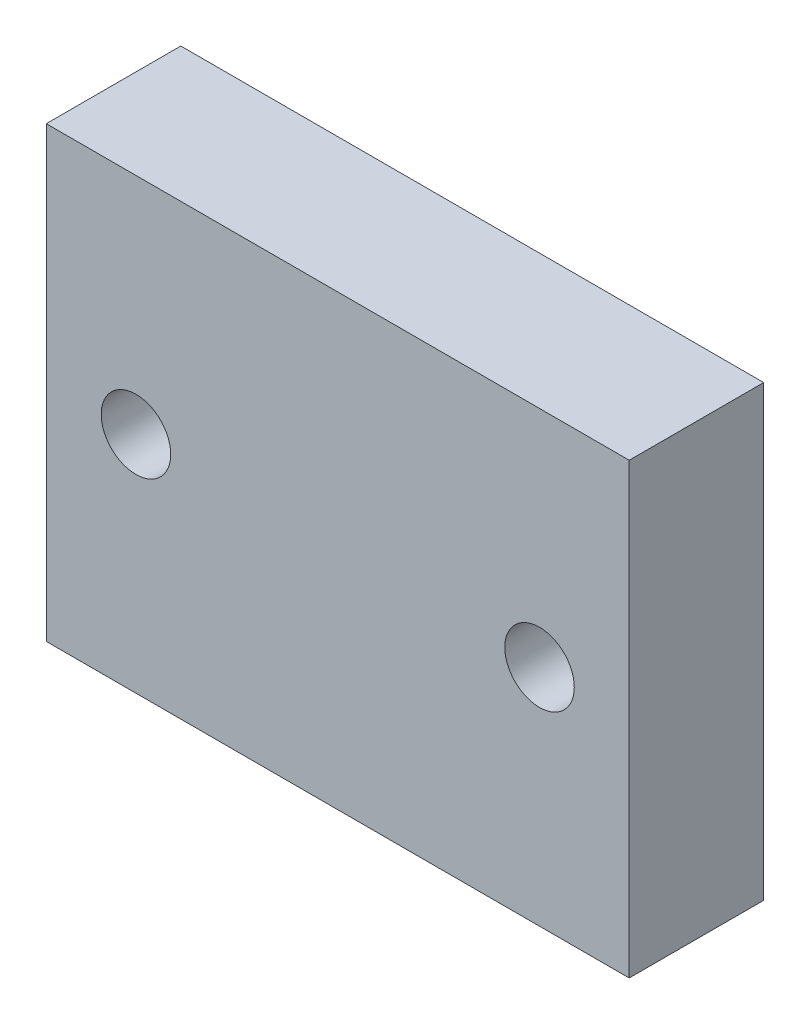
ISO-10303-21;
HEADER;
FILE_DESCRIPTION(('STEP AP214'),'2;1');
FILE_NAME('part.step','',(''),(''),'','','');
FILE_SCHEMA(('AUTOMOTIVE_DESIGN { 1 0 10303 214 1 1 1 1 }'));
ENDSEC;
DATA;
#1=APPLICATION_CONTEXT('core data for automotive mechanical design processes');
#2=APPLICATION_PROTOCOL_DEFINITION('international standard','automotive_design',2000,#1);
#3=PRODUCT_CONTEXT('',#1,'mechanical');
#4=PRODUCT('Part','Part','',(#3));
#5=PRODUCT_RELATED_PRODUCT_CATEGORY('part','',(#4));
#6=PRODUCT_DEFINITION_FORMATION('','',#4);
#7=PRODUCT_DEFINITION_CONTEXT('part definition',#1,'design');
#8=PRODUCT_DEFINITION('design','',#6,#7);
#9=PRODUCT_DEFINITION_SHAPE('','',#8);
#10=(LENGTH_UNIT() NAMED_UNIT(*) SI_UNIT(.MILLI.,.METRE.));
#11=(NAMED_UNIT(*) PLANE_ANGLE_UNIT() SI_UNIT($,.RADIAN.));
#12=(NAMED_UNIT(*) SI_UNIT($,.STERADIAN.) SOLID_ANGLE_UNIT());
#13=UNCERTAINTY_MEASURE_WITH_UNIT(LENGTH_MEASURE(1.E-05),#10,'distance_accuracy_value','');
#14=(GEOMETRIC_REPRESENTATION_CONTEXT(3) GLOBAL_UNCERTAINTY_ASSIGNED_CONTEXT((#13)) GLOBAL_UNIT_ASSIGNED_CONTEXT((#10,
#11,#12)) REPRESENTATION_CONTEXT('',''));
#15=CARTESIAN_POINT('',(0.,0.,0.));
#16=DIRECTION('',(0.,0.,1.));
#17=DIRECTION('',(1.,0.,0.));
#18=AXIS2_PLACEMENT_3D('',#15,#16,#17);
#19=CARTESIAN_POINT('',(0.,0.,6.));
#20=DIRECTION('',(0.,0.,1.));
#21=DIRECTION('',(1.,0.,0.));
#22=AXIS2_PLACEMENT_3D('',#19,#20,#21);
#23=PLANE('',#22);
#24=CARTESIAN_POINT('',(9.,0.,6.));
#25=DIRECTION('',(0.,0.,1.));
#26=DIRECTION('',(1.,0.,0.));
#27=AXIS2_PLACEMENT_3D('',#24,#25,#26);
#28=CIRCLE('',#27,1.55);
#29=CARTESIAN_POINT('',(10.55,0.,6.));
#30=VERTEX_POINT('',#29);
#31=EDGE_CURVE('E136',#30,#30,#28,.T.);
#32=ORIENTED_EDGE('',*,*,#31,.F.);
#33=EDGE_LOOP('',(#32));
#34=FACE_BOUND('',#33,.T.);
#35=DIRECTION('',(0.,-1.,0.));
#36=VECTOR('',#35,1.);
#37=CARTESIAN_POINT('',(-13.,-10.,6.));
#38=LINE('',#37,#36);
#39=CARTESIAN_POINT('',(-13.,10.,6.));
#40=VERTEX_POINT('',#39);
#41=CARTESIAN_POINT('',(-13.,-10.,6.));
#42=VERTEX_POINT('',#41);
#43=EDGE_CURVE('E142',#40,#42,#38,.T.);
#44=ORIENTED_EDGE('',*,*,#43,.T.);
#45=DIRECTION('',(1.,0.,0.));
#46=VECTOR('',#45,1.);
#47=CARTESIAN_POINT('',(13.,-10.,6.));
#48=LINE('',#47,#46);
#49=CARTESIAN_POINT('',(13.,-10.,6.));
#50=VERTEX_POINT('',#49);
#51=EDGE_CURVE('E145',#42,#50,#48,.T.);
#52=ORIENTED_EDGE('',*,*,#51,.T.);
#53=DIRECTION('',(0.,1.,0.));
#54=VECTOR('',#53,1.);
#55=CARTESIAN_POINT('',(13.,-10.,6.));
#56=LINE('',#55,#54);
#57=CARTESIAN_POINT('',(13.,10.,6.));
#58=VERTEX_POINT('',#57);
#59=EDGE_CURVE('E148',#50,#58,#56,.T.);
#60=ORIENTED_EDGE('',*,*,#59,.T.);
#61=DIRECTION('',(-1.,0.,0.));
#62=VECTOR('',#61,1.);
#63=CARTESIAN_POINT('',(13.,10.,6.));
#64=LINE('',#63,#62);
#65=EDGE_CURVE('E150',#58,#40,#64,.T.);
#66=ORIENTED_EDGE('',*,*,#65,.T.);
#67=EDGE_LOOP('',(#44,#52,#60,#66));
#68=FACE_BOUND('',#67,.T.);
#69=CARTESIAN_POINT('',(-9.,0.,6.));
#70=DIRECTION('',(0.,0.,1.));
#71=DIRECTION('',(1.,0.,0.));
#72=AXIS2_PLACEMENT_3D('',#69,#70,#71);
#73=CIRCLE('',#72,1.55);
#74=CARTESIAN_POINT('',(-7.45,0.,6.));
#75=VERTEX_POINT('',#74);
#76=EDGE_CURVE('E130',#75,#75,#73,.T.);
#77=ORIENTED_EDGE('',*,*,#76,.F.);
#78=EDGE_LOOP('',(#77));
#79=FACE_BOUND('',#78,.T.);
#80=ADVANCED_FACE('F34',(#34,#68,#79),#23,.T.);
#81=CARTESIAN_POINT('',(0.,0.,0.));
#82=DIRECTION('',(0.,0.,1.));
#83=DIRECTION('',(1.,0.,0.));
#84=AXIS2_PLACEMENT_3D('',#81,#82,#83);
#85=PLANE('',#84);
#86=DIRECTION('',(0.,-1.,0.));
#87=VECTOR('',#86,1.);
#88=CARTESIAN_POINT('',(5.,4.,0.));
#89=LINE('',#88,#87);
#90=CARTESIAN_POINT('',(5.,5.00000000000001,0.));
#91=VERTEX_POINT('',#90);
#92=CARTESIAN_POINT('',(5.,2.,0.));
#93=VERTEX_POINT('',#92);
#94=EDGE_CURVE('E50',#91,#93,#89,.T.);
#95=ORIENTED_EDGE('',*,*,#94,.F.);
#96=DIRECTION('',(-1.,0.,0.));
#97=VECTOR('',#96,1.);
#98=CARTESIAN_POINT('',(0.,5.00000000000001,0.));
#99=LINE('',#98,#97);
#100=CARTESIAN_POINT('',(-5.,5.00000000000001,0.));
#101=VERTEX_POINT('',#100);
#102=EDGE_CURVE('E171',#91,#101,#99,.T.);
#103=ORIENTED_EDGE('',*,*,#102,.T.);
#104=DIRECTION('',(0.,1.,0.));
#105=VECTOR('',#104,1.);
#106=CARTESIAN_POINT('',(-5.,4.,0.));
#107=LINE('',#106,#105);
#108=CARTESIAN_POINT('',(-5.,2.,0.));
#109=VERTEX_POINT('',#108);
#110=EDGE_CURVE('E57',#109,#101,#107,.T.);
#111=ORIENTED_EDGE('',*,*,#110,.F.);
#112=DIRECTION('',(-1.,0.,0.));
#113=VECTOR('',#112,1.);
#114=CARTESIAN_POINT('',(5.,2.,0.));
#115=LINE('',#114,#113);
#116=EDGE_CURVE('E121',#93,#109,#115,.T.);
#117=ORIENTED_EDGE('',*,*,#116,.F.);
#118=EDGE_LOOP('',(#95,#103,#111,#117));
#119=FACE_BOUND('',#118,.T.);
#120=DIRECTION('',(0.,-1.,0.));
#121=VECTOR('',#120,1.);
#122=CARTESIAN_POINT('',(-13.,-10.,0.));
#123=LINE('',#122,#121);
#124=CARTESIAN_POINT('',(-13.,10.,0.));
#125=VERTEX_POINT('',#124);
#126=CARTESIAN_POINT('',(-13.,-10.,0.));
#127=VERTEX_POINT('',#126);
#128=EDGE_CURVE('E139',#125,#127,#123,.T.);
#129=ORIENTED_EDGE('',*,*,#128,.F.);
#130=DIRECTION('',(-1.,0.,0.));
#131=VECTOR('',#130,1.);
#132=CARTESIAN_POINT('',(13.,10.,0.));
#133=LINE('',#132,#131);
#134=CARTESIAN_POINT('',(13.,10.,0.));
#135=VERTEX_POINT('',#134);
#136=EDGE_CURVE('E146',#135,#125,#133,.T.);
#137=ORIENTED_EDGE('',*,*,#136,.F.);
#138=DIRECTION('',(0.,1.,0.));
#139=VECTOR('',#138,1.);
#140=CARTESIAN_POINT('',(13.,-10.,0.));
#141=LINE('',#140,#139);
#142=CARTESIAN_POINT('',(13.,-10.,0.));
#143=VERTEX_POINT('',#142);
#144=EDGE_CURVE('E157',#143,#135,#141,.T.);
#145=ORIENTED_EDGE('',*,*,#144,.F.);
#146=DIRECTION('',(1.,0.,0.));
#147=VECTOR('',#146,1.);
#148=CARTESIAN_POINT('',(13.,-10.,0.));
#149=LINE('',#148,#147);
#150=EDGE_CURVE('E155',#127,#143,#149,.T.);
#151=ORIENTED_EDGE('',*,*,#150,.F.);
#152=EDGE_LOOP('',(#129,#137,#145,#151));
#153=FACE_BOUND('',#152,.T.);
#154=CARTESIAN_POINT('',(9.,0.,0.));
#155=DIRECTION('',(0.,0.,1.));
#156=DIRECTION('',(1.,0.,0.));
#157=AXIS2_PLACEMENT_3D('',#154,#155,#156);
#158=CIRCLE('',#157,1.55);
#159=CARTESIAN_POINT('',(10.55,0.,0.));
#160=VERTEX_POINT('',#159);
#161=EDGE_CURVE('E133',#160,#160,#158,.T.);
#162=ORIENTED_EDGE('',*,*,#161,.T.);
#163=EDGE_LOOP('',(#162));
#164=FACE_BOUND('',#163,.T.);
#165=CARTESIAN_POINT('',(-9.,0.,0.));
#166=DIRECTION('',(0.,0.,1.));
#167=DIRECTION('',(1.,0.,0.));
#168=AXIS2_PLACEMENT_3D('',#165,#166,#167);
#169=CIRCLE('',#168,1.55);
#170=CARTESIAN_POINT('',(-7.45,0.,0.));
#171=VERTEX_POINT('',#170);
#172=EDGE_CURVE('E128',#171,#171,#169,.T.);
#173=ORIENTED_EDGE('',*,*,#172,.T.);
#174=EDGE_LOOP('',(#173));
#175=FACE_BOUND('',#174,.T.);
#176=ADVANCED_FACE('F175',(#119,#153,#164,#175),#85,.F.);
#177=CARTESIAN_POINT('',(-13.,-10.,6.));
#178=DIRECTION('',(1.,0.,0.));
#179=DIRECTION('',(0.,0.,-1.));
#180=AXIS2_PLACEMENT_3D('',#177,#178,#179);
#181=PLANE('',#180);
#182=ORIENTED_EDGE('',*,*,#128,.T.);
#183=DIRECTION('',(0.,0.,-1.));
#184=VECTOR('',#183,1.);
#185=CARTESIAN_POINT('',(-13.,-10.,6.));
#186=LINE('',#185,#184);
#187=EDGE_CURVE('E168',#42,#127,#186,.T.);
#188=ORIENTED_EDGE('',*,*,#187,.F.);
#189=ORIENTED_EDGE('',*,*,#43,.F.);
#190=DIRECTION('',(0.,0.,-1.));
#191=VECTOR('',#190,1.);
#192=CARTESIAN_POINT('',(-13.,10.,6.));
#193=LINE('',#192,#191);
#194=EDGE_CURVE('E152',#40,#125,#193,.T.);
#195=ORIENTED_EDGE('',*,*,#194,.T.);
#196=EDGE_LOOP('',(#182,#188,#189,#195));
#197=FACE_BOUND('',#196,.T.);
#198=ADVANCED_FACE('F178',(#197),#181,.F.);
#199=CARTESIAN_POINT('',(13.,-10.,6.));
#200=DIRECTION('',(0.,1.,0.));
#201=DIRECTION('',(-1.,0.,0.));
#202=AXIS2_PLACEMENT_3D('',#199,#200,#201);
#203=PLANE('',#202);
#204=ORIENTED_EDGE('',*,*,#150,.T.);
#205=DIRECTION('',(0.,0.,-1.));
#206=VECTOR('',#205,1.);
#207=CARTESIAN_POINT('',(13.,-10.,6.));
#208=LINE('',#207,#206);
#209=EDGE_CURVE('E165',#50,#143,#208,.T.);
#210=ORIENTED_EDGE('',*,*,#209,.F.);
#211=ORIENTED_EDGE('',*,*,#51,.F.);
#212=ORIENTED_EDGE('',*,*,#187,.T.);
#213=EDGE_LOOP('',(#204,#210,#211,#212));
#214=FACE_BOUND('',#213,.T.);
#215=ADVANCED_FACE('F215',(#214),#203,.F.);
#216=CARTESIAN_POINT('',(13.,-10.,6.));
#217=DIRECTION('',(-1.,0.,0.));
#218=DIRECTION('',(0.,0.,1.));
#219=AXIS2_PLACEMENT_3D('',#216,#217,#218);
#220=PLANE('',#219);
#221=ORIENTED_EDGE('',*,*,#144,.T.);
#222=DIRECTION('',(0.,0.,-1.));
#223=VECTOR('',#222,1.);
#224=CARTESIAN_POINT('',(13.,10.,6.));
#225=LINE('',#224,#223);
#226=EDGE_CURVE('E162',#58,#135,#225,.T.);
#227=ORIENTED_EDGE('',*,*,#226,.F.);
#228=ORIENTED_EDGE('',*,*,#59,.F.);
#229=ORIENTED_EDGE('',*,*,#209,.T.);
#230=EDGE_LOOP('',(#221,#227,#228,#229));
#231=FACE_BOUND('',#230,.T.);
#232=ADVANCED_FACE('F211',(#231),#220,.F.);
#233=CARTESIAN_POINT('',(13.,10.,6.));
#234=DIRECTION('',(0.,-1.,0.));
#235=DIRECTION('',(1.,0.,0.));
#236=AXIS2_PLACEMENT_3D('',#233,#234,#235);
#237=PLANE('',#236);
#238=ORIENTED_EDGE('',*,*,#136,.T.);
#239=ORIENTED_EDGE('',*,*,#194,.F.);
#240=ORIENTED_EDGE('',*,*,#65,.F.);
#241=ORIENTED_EDGE('',*,*,#226,.T.);
#242=EDGE_LOOP('',(#238,#239,#240,#241));
#243=FACE_BOUND('',#242,.T.);
#244=ADVANCED_FACE('F198',(#243),#237,.F.);
#245=CARTESIAN_POINT('',(9.,0.,6.));
#246=DIRECTION('',(0.,0.,-1.));
#247=DIRECTION('',(-1.,0.,0.));
#248=AXIS2_PLACEMENT_3D('',#245,#246,#247);
#249=CYLINDRICAL_SURFACE('',#248,1.55);
#250=ORIENTED_EDGE('',*,*,#31,.T.);
#251=EDGE_LOOP('',(#250));
#252=FACE_BOUND('',#251,.T.);
#253=ORIENTED_EDGE('',*,*,#161,.F.);
#254=EDGE_LOOP('',(#253));
#255=FACE_BOUND('',#254,.T.);
#256=ADVANCED_FACE('F189',(#252,#255),#249,.F.);
#257=CARTESIAN_POINT('',(-9.,0.,6.));
#258=DIRECTION('',(0.,0.,-1.));
#259=DIRECTION('',(-1.,0.,0.));
#260=AXIS2_PLACEMENT_3D('',#257,#258,#259);
#261=CYLINDRICAL_SURFACE('',#260,1.55);
#262=ORIENTED_EDGE('',*,*,#76,.T.);
#263=EDGE_LOOP('',(#262));
#264=FACE_BOUND('',#263,.T.);
#265=ORIENTED_EDGE('',*,*,#172,.F.);
#266=EDGE_LOOP('',(#265));
#267=FACE_BOUND('',#266,.T.);
#268=ADVANCED_FACE('F187',(#264,#267),#261,.F.);
#269=CARTESIAN_POINT('',(5.,4.,1.));
#270=DIRECTION('',(1.,0.,0.));
#271=DIRECTION('',(0.,0.,-1.));
#272=AXIS2_PLACEMENT_3D('',#269,#270,#271);
#273=PLANE('',#272);
#274=ORIENTED_EDGE('',*,*,#94,.T.);
#275=DIRECTION('',(0.,0.,-1.));
#276=VECTOR('',#275,1.);
#277=CARTESIAN_POINT('',(5.,2.,1.));
#278=LINE('',#277,#276);
#279=CARTESIAN_POINT('',(5.,2.,1.));
#280=VERTEX_POINT('',#279);
#281=EDGE_CURVE('E99',#280,#93,#278,.T.);
#282=ORIENTED_EDGE('',*,*,#281,.F.);
#283=DIRECTION('',(0.,-1.,0.));
#284=VECTOR('',#283,1.);
#285=CARTESIAN_POINT('',(5.,4.,1.));
#286=LINE('',#285,#284);
#287=CARTESIAN_POINT('',(5.,4.,1.));
#288=VERTEX_POINT('',#287);
#289=EDGE_CURVE('E103',#288,#280,#286,.T.);
#290=ORIENTED_EDGE('',*,*,#289,.F.);
#291=DIRECTION('',(0.,-0.707106781186549,0.707106781186546));
#292=VECTOR('',#291,1.);
#293=CARTESIAN_POINT('',(5.,4.,1.));
#294=LINE('',#293,#292);
#295=EDGE_CURVE('E43',#288,#91,#294,.F.);
#296=ORIENTED_EDGE('',*,*,#295,.T.);
#297=EDGE_LOOP('',(#274,#282,#290,#296));
#298=FACE_BOUND('',#297,.T.);
#299=ADVANCED_FACE('F101',(#298),#273,.F.);
#300=CARTESIAN_POINT('',(-5.,4.,1.));
#301=DIRECTION('',(-1.,0.,0.));
#302=DIRECTION('',(0.,0.,1.));
#303=AXIS2_PLACEMENT_3D('',#300,#301,#302);
#304=PLANE('',#303);
#305=ORIENTED_EDGE('',*,*,#110,.T.);
#306=DIRECTION('',(0.,0.707106781186549,-0.707106781186546));
#307=VECTOR('',#306,1.);
#308=CARTESIAN_POINT('',(-5.,4.,1.));
#309=LINE('',#308,#307);
#310=CARTESIAN_POINT('',(-5.,4.,1.));
#311=VERTEX_POINT('',#310);
#312=EDGE_CURVE('E11',#101,#311,#309,.F.);
#313=ORIENTED_EDGE('',*,*,#312,.T.);
#314=DIRECTION('',(0.,1.,0.));
#315=VECTOR('',#314,1.);
#316=CARTESIAN_POINT('',(-5.,4.,1.));
#317=LINE('',#316,#315);
#318=CARTESIAN_POINT('',(-5.,2.,1.));
#319=VERTEX_POINT('',#318);
#320=EDGE_CURVE('E116',#319,#311,#317,.T.);
#321=ORIENTED_EDGE('',*,*,#320,.F.);
#322=DIRECTION('',(0.,0.,-1.));
#323=VECTOR('',#322,1.);
#324=CARTESIAN_POINT('',(-5.,2.,1.));
#325=LINE('',#324,#323);
#326=EDGE_CURVE('E107',#319,#109,#325,.T.);
#327=ORIENTED_EDGE('',*,*,#326,.T.);
#328=EDGE_LOOP('',(#305,#313,#321,#327));
#329=FACE_BOUND('',#328,.T.);
#330=ADVANCED_FACE('F196',(#329),#304,.F.);
#331=CARTESIAN_POINT('',(5.,2.,1.));
#332=DIRECTION('',(0.,-1.,0.));
#333=DIRECTION('',(0.,0.,-1.));
#334=AXIS2_PLACEMENT_3D('',#331,#332,#333);
#335=PLANE('',#334);
#336=ORIENTED_EDGE('',*,*,#116,.T.);
#337=ORIENTED_EDGE('',*,*,#326,.F.);
#338=DIRECTION('',(-1.,0.,0.));
#339=VECTOR('',#338,1.);
#340=CARTESIAN_POINT('',(5.,2.,1.));
#341=LINE('',#340,#339);
#342=EDGE_CURVE('E111',#280,#319,#341,.T.);
#343=ORIENTED_EDGE('',*,*,#342,.F.);
#344=ORIENTED_EDGE('',*,*,#281,.T.);
#345=EDGE_LOOP('',(#336,#337,#343,#344));
#346=FACE_BOUND('',#345,.T.);
#347=ADVANCED_FACE('F112',(#346),#335,.F.);
#348=CARTESIAN_POINT('',(0.,0.,1.));
#349=DIRECTION('',(0.,0.,-1.));
#350=DIRECTION('',(-1.,0.,0.));
#351=AXIS2_PLACEMENT_3D('',#348,#349,#350);
#352=PLANE('',#351);
#353=ORIENTED_EDGE('',*,*,#289,.T.);
#354=ORIENTED_EDGE('',*,*,#342,.T.);
#355=ORIENTED_EDGE('',*,*,#320,.T.);
#356=DIRECTION('',(1.,0.,0.));
#357=VECTOR('',#356,1.);
#358=CARTESIAN_POINT('',(5.,4.,1.));
#359=LINE('',#358,#357);
#360=EDGE_CURVE('E108',#311,#288,#359,.T.);
#361=ORIENTED_EDGE('',*,*,#360,.T.);
#362=EDGE_LOOP('',(#353,#354,#355,#361));
#363=FACE_BOUND('',#362,.T.);
#364=ADVANCED_FACE('F118',(#363),#352,.T.);
#365=CARTESIAN_POINT('',(5.,4.,1.));
#366=DIRECTION('',(0.,0.707106781186546,0.707106781186549));
#367=DIRECTION('',(1.,0.,0.));
#368=AXIS2_PLACEMENT_3D('',#365,#366,#367);
#369=PLANE('',#368);
#370=ORIENTED_EDGE('',*,*,#312,.F.);
#371=ORIENTED_EDGE('',*,*,#102,.F.);
#372=ORIENTED_EDGE('',*,*,#295,.F.);
#373=ORIENTED_EDGE('',*,*,#360,.F.);
#374=EDGE_LOOP('',(#370,#371,#372,#373));
#375=FACE_BOUND('',#374,.T.);
#376=ADVANCED_FACE('F37',(#375),#369,.F.);
#377=CLOSED_SHELL('',(#80,#176,#198,#215,#232,#244,#256,#268,#299,#330,#347,#364,#376));
#378=MANIFOLD_SOLID_BREP('B2',#377);
#379=ADVANCED_BREP_SHAPE_REPRESENTATION('',(#18,#378),#14);
#380=SHAPE_DEFINITION_REPRESENTATION(#9,#379);
ENDSEC;
END-ISO-10303-21;
